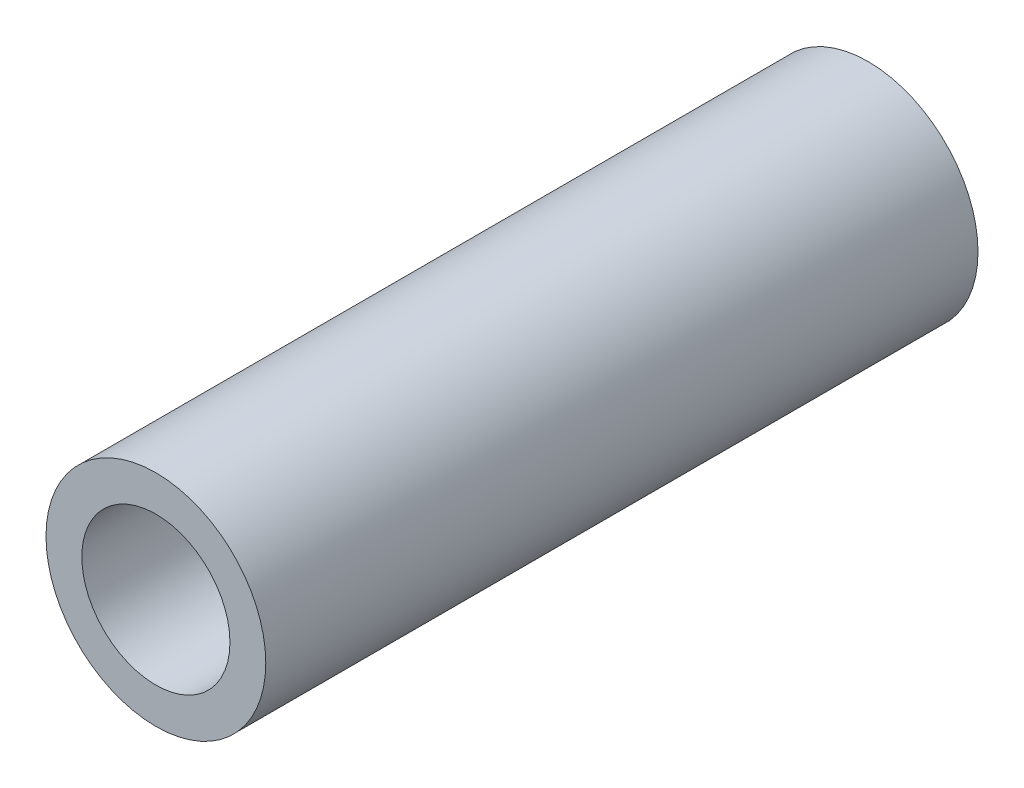
ISO-10303-21;
HEADER;
FILE_DESCRIPTION(('STEP AP214'),'2;1');
FILE_NAME('part.step','',(''),(''),'','','');
FILE_SCHEMA(('AUTOMOTIVE_DESIGN { 1 0 10303 214 1 1 1 1 }'));
ENDSEC;
DATA;
#1=APPLICATION_CONTEXT('core data for automotive mechanical design processes');
#2=APPLICATION_PROTOCOL_DEFINITION('international standard','automotive_design',2000,#1);
#3=PRODUCT_CONTEXT('',#1,'mechanical');
#4=PRODUCT('Part','Part','',(#3));
#5=PRODUCT_RELATED_PRODUCT_CATEGORY('part','',(#4));
#6=PRODUCT_DEFINITION_FORMATION('','',#4);
#7=PRODUCT_DEFINITION_CONTEXT('part definition',#1,'design');
#8=PRODUCT_DEFINITION('design','',#6,#7);
#9=PRODUCT_DEFINITION_SHAPE('','',#8);
#10=(LENGTH_UNIT() NAMED_UNIT(*) SI_UNIT(.MILLI.,.METRE.));
#11=(NAMED_UNIT(*) PLANE_ANGLE_UNIT() SI_UNIT($,.RADIAN.));
#12=(NAMED_UNIT(*) SI_UNIT($,.STERADIAN.) SOLID_ANGLE_UNIT());
#13=UNCERTAINTY_MEASURE_WITH_UNIT(LENGTH_MEASURE(1.E-05),#10,'distance_accuracy_value','');
#14=(GEOMETRIC_REPRESENTATION_CONTEXT(3) GLOBAL_UNCERTAINTY_ASSIGNED_CONTEXT((#13)) GLOBAL_UNIT_ASSIGNED_CONTEXT((#10,
#11,#12)) REPRESENTATION_CONTEXT('',''));
#15=CARTESIAN_POINT('',(0.,0.,0.));
#16=DIRECTION('',(0.,0.,1.));
#17=DIRECTION('',(1.,0.,0.));
#18=AXIS2_PLACEMENT_3D('',#15,#16,#17);
#19=CARTESIAN_POINT('',(0.,0.,22.225));
#20=DIRECTION('',(0.,0.,1.));
#21=DIRECTION('',(1.,0.,0.));
#22=AXIS2_PLACEMENT_3D('',#19,#20,#21);
#23=PLANE('',#22);
#24=CARTESIAN_POINT('',(0.,0.,22.225));
#25=DIRECTION('',(0.,0.,1.));
#26=DIRECTION('',(1.,0.,0.));
#27=AXIS2_PLACEMENT_3D('',#24,#25,#26);
#28=CIRCLE('',#27,6.858);
#29=CARTESIAN_POINT('',(6.858,0.,22.225));
#30=VERTEX_POINT('',#29);
#31=EDGE_CURVE('E10',#30,#30,#28,.T.);
#32=ORIENTED_EDGE('',*,*,#31,.T.);
#33=EDGE_LOOP('',(#32));
#34=FACE_BOUND('',#33,.T.);
#35=CARTESIAN_POINT('',(0.,0.,22.225));
#36=DIRECTION('',(0.,0.,1.));
#37=DIRECTION('',(1.,0.,0.));
#38=AXIS2_PLACEMENT_3D('',#35,#36,#37);
#39=CIRCLE('',#38,4.6228);
#40=CARTESIAN_POINT('',(4.6228,0.,22.225));
#41=VERTEX_POINT('',#40);
#42=EDGE_CURVE('E46',#41,#41,#39,.T.);
#43=ORIENTED_EDGE('',*,*,#42,.F.);
#44=EDGE_LOOP('',(#43));
#45=FACE_BOUND('',#44,.T.);
#46=ADVANCED_FACE('F35',(#34,#45),#23,.T.);
#47=CARTESIAN_POINT('',(0.,0.,-22.225));
#48=DIRECTION('',(0.,0.,1.));
#49=DIRECTION('',(1.,0.,0.));
#50=AXIS2_PLACEMENT_3D('',#47,#48,#49);
#51=PLANE('',#50);
#52=CARTESIAN_POINT('',(0.,0.,-22.225));
#53=DIRECTION('',(0.,0.,1.));
#54=DIRECTION('',(1.,0.,0.));
#55=AXIS2_PLACEMENT_3D('',#52,#53,#54);
#56=CIRCLE('',#55,6.858);
#57=CARTESIAN_POINT('',(6.858,0.,-22.225));
#58=VERTEX_POINT('',#57);
#59=EDGE_CURVE('E39',#58,#58,#56,.T.);
#60=ORIENTED_EDGE('',*,*,#59,.F.);
#61=EDGE_LOOP('',(#60));
#62=FACE_BOUND('',#61,.T.);
#63=CARTESIAN_POINT('',(0.,0.,-22.225));
#64=DIRECTION('',(0.,0.,1.));
#65=DIRECTION('',(1.,0.,0.));
#66=AXIS2_PLACEMENT_3D('',#63,#64,#65);
#67=CIRCLE('',#66,4.6228);
#68=CARTESIAN_POINT('',(4.6228,0.,-22.225));
#69=VERTEX_POINT('',#68);
#70=EDGE_CURVE('E48',#69,#69,#67,.T.);
#71=ORIENTED_EDGE('',*,*,#70,.T.);
#72=EDGE_LOOP('',(#71));
#73=FACE_BOUND('',#72,.T.);
#74=ADVANCED_FACE('F58',(#62,#73),#51,.F.);
#75=CARTESIAN_POINT('',(0.,0.,22.225));
#76=DIRECTION('',(0.,0.,-1.));
#77=DIRECTION('',(-1.,0.,0.));
#78=AXIS2_PLACEMENT_3D('',#75,#76,#77);
#79=CYLINDRICAL_SURFACE('',#78,6.858);
#80=ORIENTED_EDGE('',*,*,#31,.F.);
#81=EDGE_LOOP('',(#80));
#82=FACE_BOUND('',#81,.T.);
#83=ORIENTED_EDGE('',*,*,#59,.T.);
#84=EDGE_LOOP('',(#83));
#85=FACE_BOUND('',#84,.T.);
#86=ADVANCED_FACE('F37',(#82,#85),#79,.T.);
#87=CARTESIAN_POINT('',(0.,0.,22.225));
#88=DIRECTION('',(0.,0.,-1.));
#89=DIRECTION('',(-1.,0.,0.));
#90=AXIS2_PLACEMENT_3D('',#87,#88,#89);
#91=CYLINDRICAL_SURFACE('',#90,4.6228);
#92=ORIENTED_EDGE('',*,*,#42,.T.);
#93=EDGE_LOOP('',(#92));
#94=FACE_BOUND('',#93,.T.);
#95=ORIENTED_EDGE('',*,*,#70,.F.);
#96=EDGE_LOOP('',(#95));
#97=FACE_BOUND('',#96,.T.);
#98=ADVANCED_FACE('F54',(#94,#97),#91,.F.);
#99=CLOSED_SHELL('',(#46,#74,#86,#98));
#100=MANIFOLD_SOLID_BREP('B2',#99);
#101=ADVANCED_BREP_SHAPE_REPRESENTATION('',(#18,#100),#14);
#102=SHAPE_DEFINITION_REPRESENTATION(#9,#101);
ENDSEC;
END-ISO-10303-21;
